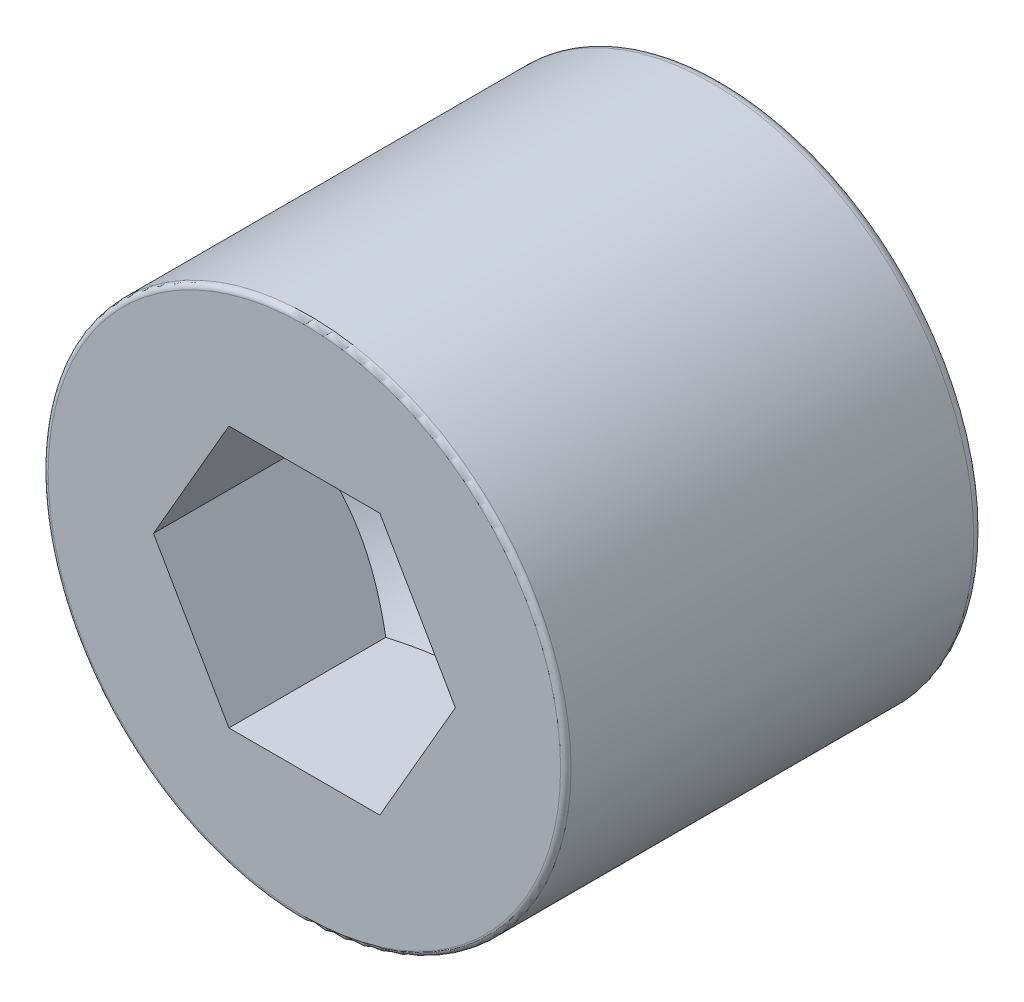
ISO-10303-21;
HEADER;
FILE_DESCRIPTION(('STEP AP214'),'2;1');
FILE_NAME('part.step','',(''),(''),'','','');
FILE_SCHEMA(('AUTOMOTIVE_DESIGN { 1 0 10303 214 1 1 1 1 }'));
ENDSEC;
DATA;
#1=APPLICATION_CONTEXT('core data for automotive mechanical design processes');
#2=APPLICATION_PROTOCOL_DEFINITION('international standard','automotive_design',2000,#1);
#3=PRODUCT_CONTEXT('',#1,'mechanical');
#4=PRODUCT('Part','Part','',(#3));
#5=PRODUCT_RELATED_PRODUCT_CATEGORY('part','',(#4));
#6=PRODUCT_DEFINITION_FORMATION('','',#4);
#7=PRODUCT_DEFINITION_CONTEXT('part definition',#1,'design');
#8=PRODUCT_DEFINITION('design','',#6,#7);
#9=PRODUCT_DEFINITION_SHAPE('','',#8);
#10=(LENGTH_UNIT() NAMED_UNIT(*) SI_UNIT(.MILLI.,.METRE.));
#11=(NAMED_UNIT(*) PLANE_ANGLE_UNIT() SI_UNIT($,.RADIAN.));
#12=(NAMED_UNIT(*) SI_UNIT($,.STERADIAN.) SOLID_ANGLE_UNIT());
#13=UNCERTAINTY_MEASURE_WITH_UNIT(LENGTH_MEASURE(1.E-05),#10,'distance_accuracy_value','');
#14=(GEOMETRIC_REPRESENTATION_CONTEXT(3) GLOBAL_UNCERTAINTY_ASSIGNED_CONTEXT((#13)) GLOBAL_UNIT_ASSIGNED_CONTEXT((#10,
#11,#12)) REPRESENTATION_CONTEXT('',''));
#15=CARTESIAN_POINT('',(0.,0.,0.));
#16=DIRECTION('',(0.,0.,1.));
#17=DIRECTION('',(1.,0.,0.));
#18=AXIS2_PLACEMENT_3D('',#15,#16,#17);
#19=CARTESIAN_POINT('',(0.,0.,80.));
#20=DIRECTION('',(0.,0.,-1.));
#21=DIRECTION('',(-1.,0.,0.));
#22=AXIS2_PLACEMENT_3D('',#19,#20,#21);
#23=CYLINDRICAL_SURFACE('',#22,9.);
#24=CARTESIAN_POINT('',(0.,0.,2.));
#25=DIRECTION('',(0.,0.,1.));
#26=DIRECTION('',(1.,0.,0.));
#27=AXIS2_PLACEMENT_3D('',#24,#25,#26);
#28=CIRCLE('',#27,9.);
#29=CARTESIAN_POINT('',(9.,0.,2.));
#30=VERTEX_POINT('',#29);
#31=EDGE_CURVE('E153',#30,#30,#28,.F.);
#32=ORIENTED_EDGE('',*,*,#31,.T.);
#33=EDGE_LOOP('',(#32));
#34=FACE_BOUND('',#33,.T.);
#35=CARTESIAN_POINT('',(0.,0.,38.5294857560401));
#36=DIRECTION('',(0.,0.,1.));
#37=DIRECTION('',(1.,0.,0.));
#38=AXIS2_PLACEMENT_3D('',#35,#36,#37);
#39=CIRCLE('',#38,9.);
#40=CARTESIAN_POINT('',(9.00000000000001,0.,38.5294857560401));
#41=VERTEX_POINT('',#40);
#42=EDGE_CURVE('E44',#41,#41,#39,.T.);
#43=ORIENTED_EDGE('',*,*,#42,.T.);
#44=EDGE_LOOP('',(#43));
#45=FACE_BOUND('',#44,.T.);
#46=ADVANCED_FACE('F40',(#34,#45),#23,.F.);
#47=CARTESIAN_POINT('',(0.,0.,80.));
#48=DIRECTION('',(0.,0.,1.));
#49=DIRECTION('',(1.,0.,0.));
#50=AXIS2_PLACEMENT_3D('',#47,#48,#49);
#51=PLANE('',#50);
#52=DIRECTION('',(0.5,0.866025403784439,0.));
#53=VECTOR('',#52,1.);
#54=CARTESIAN_POINT('',(14.4337567297406,-25.,80.));
#55=LINE('',#54,#53);
#56=CARTESIAN_POINT('',(14.4337567297406,-25.,80.));
#57=VERTEX_POINT('',#56);
#58=CARTESIAN_POINT('',(28.8675134594813,0.,80.));
#59=VERTEX_POINT('',#58);
#60=EDGE_CURVE('E56',#57,#59,#55,.T.);
#61=ORIENTED_EDGE('',*,*,#60,.F.);
#62=DIRECTION('',(1.,0.,0.));
#63=VECTOR('',#62,1.);
#64=CARTESIAN_POINT('',(-14.4337567297406,-25.,80.));
#65=LINE('',#64,#63);
#66=CARTESIAN_POINT('',(-14.4337567297406,-25.,80.));
#67=VERTEX_POINT('',#66);
#68=EDGE_CURVE('E110',#67,#57,#65,.T.);
#69=ORIENTED_EDGE('',*,*,#68,.F.);
#70=DIRECTION('',(0.5,-0.866025403784438,0.));
#71=VECTOR('',#70,1.);
#72=CARTESIAN_POINT('',(-28.8675134594813,0.,80.));
#73=LINE('',#72,#71);
#74=CARTESIAN_POINT('',(-28.8675134594813,0.,80.));
#75=VERTEX_POINT('',#74);
#76=EDGE_CURVE('E115',#75,#67,#73,.T.);
#77=ORIENTED_EDGE('',*,*,#76,.F.);
#78=DIRECTION('',(-0.5,-0.866025403784439,0.));
#79=VECTOR('',#78,1.);
#80=CARTESIAN_POINT('',(-14.4337567297406,25.,80.));
#81=LINE('',#80,#79);
#82=CARTESIAN_POINT('',(-14.4337567297406,25.,80.));
#83=VERTEX_POINT('',#82);
#84=EDGE_CURVE('E336',#83,#75,#81,.T.);
#85=ORIENTED_EDGE('',*,*,#84,.F.);
#86=DIRECTION('',(-1.,0.,0.));
#87=VECTOR('',#86,1.);
#88=CARTESIAN_POINT('',(14.4337567297406,25.,80.));
#89=LINE('',#88,#87);
#90=CARTESIAN_POINT('',(14.4337567297406,25.,80.));
#91=VERTEX_POINT('',#90);
#92=EDGE_CURVE('E334',#91,#83,#89,.T.);
#93=ORIENTED_EDGE('',*,*,#92,.F.);
#94=DIRECTION('',(-0.5,0.866025403784438,0.));
#95=VECTOR('',#94,1.);
#96=CARTESIAN_POINT('',(28.8675134594813,0.,80.));
#97=LINE('',#96,#95);
#98=EDGE_CURVE('E337',#59,#91,#97,.T.);
#99=ORIENTED_EDGE('',*,*,#98,.F.);
#100=EDGE_LOOP('',(#61,#69,#77,#85,#93,#99));
#101=FACE_BOUND('',#100,.T.);
#102=CARTESIAN_POINT('',(0.,0.,80.));
#103=DIRECTION('',(0.,0.,1.));
#104=DIRECTION('',(1.,0.,0.));
#105=AXIS2_PLACEMENT_3D('',#102,#103,#104);
#106=CIRCLE('',#105,49.);
#107=CARTESIAN_POINT('',(49.,0.,80.));
#108=VERTEX_POINT('',#107);
#109=EDGE_CURVE('E49',#108,#108,#106,.T.);
#110=ORIENTED_EDGE('',*,*,#109,.T.);
#111=EDGE_LOOP('',(#110));
#112=FACE_BOUND('',#111,.T.);
#113=ADVANCED_FACE('F162',(#101,#112),#51,.T.);
#114=CARTESIAN_POINT('',(0.,0.,0.));
#115=DIRECTION('',(0.,0.,1.));
#116=DIRECTION('',(1.,0.,0.));
#117=AXIS2_PLACEMENT_3D('',#114,#115,#116);
#118=PLANE('',#117);
#119=CARTESIAN_POINT('',(0.,0.,0.));
#120=DIRECTION('',(0.,0.,1.));
#121=DIRECTION('',(1.,0.,0.));
#122=AXIS2_PLACEMENT_3D('',#119,#120,#121);
#123=CIRCLE('',#122,11.);
#124=CARTESIAN_POINT('',(11.,0.,0.));
#125=VERTEX_POINT('',#124);
#126=EDGE_CURVE('E150',#125,#125,#123,.T.);
#127=ORIENTED_EDGE('',*,*,#126,.T.);
#128=EDGE_LOOP('',(#127));
#129=FACE_BOUND('',#128,.T.);
#130=CARTESIAN_POINT('',(0.,0.,0.));
#131=DIRECTION('',(0.,0.,1.));
#132=DIRECTION('',(1.,0.,0.));
#133=AXIS2_PLACEMENT_3D('',#130,#131,#132);
#134=CIRCLE('',#133,48.);
#135=CARTESIAN_POINT('',(48.,0.,0.));
#136=VERTEX_POINT('',#135);
#137=EDGE_CURVE('E147',#136,#136,#134,.F.);
#138=ORIENTED_EDGE('',*,*,#137,.T.);
#139=EDGE_LOOP('',(#138));
#140=FACE_BOUND('',#139,.T.);
#141=ADVANCED_FACE('F182',(#129,#140),#118,.F.);
#142=CARTESIAN_POINT('',(0.,0.,80.));
#143=DIRECTION('',(0.,0.,-1.));
#144=DIRECTION('',(-1.,0.,0.));
#145=AXIS2_PLACEMENT_3D('',#142,#143,#144);
#146=CYLINDRICAL_SURFACE('',#145,50.);
#147=CARTESIAN_POINT('',(0.,0.,79.));
#148=DIRECTION('',(0.,0.,1.));
#149=DIRECTION('',(1.,0.,0.));
#150=AXIS2_PLACEMENT_3D('',#147,#148,#149);
#151=CIRCLE('',#150,50.);
#152=CARTESIAN_POINT('',(50.,0.,79.));
#153=VERTEX_POINT('',#152);
#154=EDGE_CURVE('E12',#153,#153,#151,.F.);
#155=ORIENTED_EDGE('',*,*,#154,.T.);
#156=EDGE_LOOP('',(#155));
#157=FACE_BOUND('',#156,.T.);
#158=CARTESIAN_POINT('',(0.,0.,2.));
#159=DIRECTION('',(0.,0.,1.));
#160=DIRECTION('',(1.,0.,0.));
#161=AXIS2_PLACEMENT_3D('',#158,#159,#160);
#162=CIRCLE('',#161,50.);
#163=CARTESIAN_POINT('',(50.,0.,2.));
#164=VERTEX_POINT('',#163);
#165=EDGE_CURVE('E156',#164,#164,#162,.T.);
#166=ORIENTED_EDGE('',*,*,#165,.T.);
#167=EDGE_LOOP('',(#166));
#168=FACE_BOUND('',#167,.T.);
#169=ADVANCED_FACE('F190',(#157,#168),#146,.T.);
#170=CARTESIAN_POINT('',(0.,0.,2.));
#171=DIRECTION('',(0.,0.,1.));
#172=DIRECTION('',(1.,0.,0.));
#173=AXIS2_PLACEMENT_3D('',#170,#171,#172);
#174=TOROIDAL_SURFACE('',#173,11.,2.);
#175=ORIENTED_EDGE('',*,*,#31,.F.);
#176=EDGE_LOOP('',(#175));
#177=FACE_BOUND('',#176,.T.);
#178=ORIENTED_EDGE('',*,*,#126,.F.);
#179=EDGE_LOOP('',(#178));
#180=FACE_BOUND('',#179,.T.);
#181=ADVANCED_FACE('F173',(#177,#180),#174,.T.);
#182=CARTESIAN_POINT('',(0.,0.,2.));
#183=DIRECTION('',(0.,0.,1.));
#184=DIRECTION('',(1.,0.,0.));
#185=AXIS2_PLACEMENT_3D('',#182,#183,#184);
#186=TOROIDAL_SURFACE('',#185,48.,2.);
#187=ORIENTED_EDGE('',*,*,#137,.F.);
#188=EDGE_LOOP('',(#187));
#189=FACE_BOUND('',#188,.T.);
#190=ORIENTED_EDGE('',*,*,#165,.F.);
#191=EDGE_LOOP('',(#190));
#192=FACE_BOUND('',#191,.T.);
#193=ADVANCED_FACE('F165',(#189,#192),#186,.T.);
#194=CARTESIAN_POINT('',(0.,0.,79.));
#195=DIRECTION('',(0.,0.,1.));
#196=DIRECTION('',(1.,0.,0.));
#197=AXIS2_PLACEMENT_3D('',#194,#195,#196);
#198=TOROIDAL_SURFACE('',#197,49.,1.);
#199=ORIENTED_EDGE('',*,*,#154,.F.);
#200=EDGE_LOOP('',(#199));
#201=FACE_BOUND('',#200,.T.);
#202=ORIENTED_EDGE('',*,*,#109,.F.);
#203=EDGE_LOOP('',(#202));
#204=FACE_BOUND('',#203,.T.);
#205=ADVANCED_FACE('F42',(#201,#204),#198,.T.);
#206=CARTESIAN_POINT('',(14.4337567297406,-25.,50.));
#207=DIRECTION('',(0.866025403784439,-0.5,0.));
#208=DIRECTION('',(0.5,0.866025403784439,0.));
#209=AXIS2_PLACEMENT_3D('',#206,#207,#208);
#210=PLANE('',#209);
#211=ORIENTED_EDGE('',*,*,#60,.T.);
#212=DIRECTION('',(0.,0.,1.));
#213=VECTOR('',#212,1.);
#214=CARTESIAN_POINT('',(28.8675134594813,0.,50.));
#215=LINE('',#214,#213);
#216=CARTESIAN_POINT('',(28.8675134594813,0.,50.));
#217=VERTEX_POINT('',#216);
#218=EDGE_CURVE('E104',#217,#59,#215,.T.);
#219=ORIENTED_EDGE('',*,*,#218,.F.);
#220=CARTESIAN_POINT('',(14.4336412596868,-25.0002,50.0000666670667));
#221=CARTESIAN_POINT('',(14.7508889118247,-24.4507109479152,49.8169171055341));
#222=CARTESIAN_POINT('',(15.0693739986844,-23.8990785960212,49.6420786553923));
#223=CARTESIAN_POINT('',(15.7088980399626,-22.7913904638657,49.3113341590762));
#224=CARTESIAN_POINT('',(16.029937797561,-22.2353332924556,49.155434339716));
#225=CARTESIAN_POINT('',(16.6751984808323,-21.1177090049031,48.8646596482477));
#226=CARTESIAN_POINT('',(16.9994251046204,-20.5561320193355,48.7298349847674));
#227=CARTESIAN_POINT('',(17.6501174874694,-19.4290997521431,48.4841150397879));
#228=CARTESIAN_POINT('',(17.9765830201245,-18.8636448626643,48.3732173744819));
#229=CARTESIAN_POINT('',(18.6234085006283,-17.7433102668017,48.1800588655182));
#230=CARTESIAN_POINT('',(18.9437204702698,-17.1885136611102,48.0971592459733));
#231=CARTESIAN_POINT('',(19.5858120990366,-16.0763783369713,47.9581555673091));
#232=CARTESIAN_POINT('',(19.9075917862933,-15.5190395697991,47.9020520239789));
#233=CARTESIAN_POINT('',(20.5516916852837,-14.4034258195979,47.8180570838615));
#234=CARTESIAN_POINT('',(20.8740107966786,-13.8451527424113,47.7901321630747));
#235=CARTESIAN_POINT('',(21.518946456723,-12.7280914116015,47.7630949862358));
#236=CARTESIAN_POINT('',(21.8415629958732,-12.1693031744313,47.7639818398364));
#237=CARTESIAN_POINT('',(22.4446992895798,-11.1246404698427,47.7925557879463));
#238=CARTESIAN_POINT('',(22.725262001221,-10.6386915985708,47.8167585416179));
#239=CARTESIAN_POINT('',(23.2857176169328,-9.66795399677068,47.8864948204388));
#240=CARTESIAN_POINT('',(23.5656105305395,-9.18316524972548,47.9320280400627));
#241=CARTESIAN_POINT('',(24.1246231385452,-8.21492701058795,48.0436361154744));
#242=CARTESIAN_POINT('',(24.4037419025532,-7.73147912998034,48.1097295463408));
#243=CARTESIAN_POINT('',(24.9606429633196,-6.76689819794393,48.2612883073732));
#244=CARTESIAN_POINT('',(25.2384252657353,-6.2857651367165,48.3467535554646));
#245=CARTESIAN_POINT('',(26.0817131455789,-4.8251476834203,48.6344003548544));
#246=CARTESIAN_POINT('',(26.6448227977787,-3.84981315557773,48.8652790993936));
#247=CARTESIAN_POINT('',(27.4832685916003,-2.39758244128631,49.2583392663285));
#248=CARTESIAN_POINT('',(27.7614738214295,-1.91571684829084,49.3970082231606));
#249=CARTESIAN_POINT('',(28.3159599790537,-0.955318651191974,49.6883846478207));
#250=CARTESIAN_POINT('',(28.5922414257333,-0.476785148354278,49.8410881588956));
#251=CARTESIAN_POINT('',(28.8676289295351,0.000200000000002362,50.0000666670667));
#252=B_SPLINE_CURVE_WITH_KNOTS('',3,(#220,#221,#222,#223,#224,#225,#226,#227,#228,#229,#230,
#231,#232,#233,#234,#235,#236,#237,#238,#239,#240,#241,#242,#243,#244,#245,#246,#247,#248,#249,
#250,#251),.UNSPECIFIED.,.F.,.F.,(4,2,2,2,2,2,2,2,2,2,2,2,2,2,2,4),(0.,1.98125159104182,
3.96315284285218,5.94970601011486,7.9360611689272,9.87343019740896,11.8108365161781,
13.7459351828953,15.6809740508569,17.3655086515647,19.0500191246777,20.7360559068297,
22.4220855456996,25.8684114168823,27.5885724897119,29.3082500776184),.UNSPECIFIED.);
#253=CARTESIAN_POINT('',(14.4337567297406,-25.,50.));
#254=VERTEX_POINT('',#253);
#255=EDGE_CURVE('E93',#254,#217,#252,.T.);
#256=ORIENTED_EDGE('',*,*,#255,.F.);
#257=DIRECTION('',(0.,0.,1.));
#258=VECTOR('',#257,1.);
#259=CARTESIAN_POINT('',(14.4337567297406,-25.,50.));
#260=LINE('',#259,#258);
#261=EDGE_CURVE('E99',#254,#57,#260,.T.);
#262=ORIENTED_EDGE('',*,*,#261,.T.);
#263=EDGE_LOOP('',(#211,#219,#256,#262));
#264=FACE_BOUND('',#263,.T.);
#265=ADVANCED_FACE('F109',(#264),#210,.F.);
#266=CARTESIAN_POINT('',(-14.4337567297406,-25.,50.));
#267=DIRECTION('',(0.,-1.,0.));
#268=DIRECTION('',(1.,0.,0.));
#269=AXIS2_PLACEMENT_3D('',#266,#267,#268);
#270=PLANE('',#269);
#271=ORIENTED_EDGE('',*,*,#68,.T.);
#272=ORIENTED_EDGE('',*,*,#261,.F.);
#273=CARTESIAN_POINT('',(-37.3786280358435,-25.,59.2958822184867));
#274=CARTESIAN_POINT('',(-36.8388552327534,-25.,59.036850985562));
#275=CARTESIAN_POINT('',(-36.2984104093411,-25.,58.779215562356));
#276=CARTESIAN_POINT('',(-35.21603736722,-25.,58.2670641793695));
#277=CARTESIAN_POINT('',(-34.6741091312877,-25.,58.012548255998));
#278=CARTESIAN_POINT('',(-33.5885467781655,-25.,57.5069251925922));
#279=CARTESIAN_POINT('',(-33.0449123769917,-25.,57.2558186616244));
#280=CARTESIAN_POINT('',(-31.955884617395,-25.,56.7574550989152));
#281=CARTESIAN_POINT('',(-31.4104912636807,-25.,56.5101980568796));
#282=CARTESIAN_POINT('',(-29.7647982345782,-25.,55.7718679011237));
#283=CARTESIAN_POINT('',(-28.6615617651282,-25.,55.2873110938846));
#284=CARTESIAN_POINT('',(-26.4458262535642,-25.,54.3398964377087));
#285=CARTESIAN_POINT('',(-25.3333276963109,-25.,53.8770374612197));
#286=CARTESIAN_POINT('',(-23.6416553810389,-25.,53.1975281155783));
#287=CARTESIAN_POINT('',(-23.0665528889063,-25.,52.9707314640416));
#288=CARTESIAN_POINT('',(-21.9131724026882,-25.,52.5253728640735));
#289=CARTESIAN_POINT('',(-21.3348944633614,-25.,52.3068107741497));
#290=CARTESIAN_POINT('',(-20.174802120437,-25.,51.8789839494646));
#291=CARTESIAN_POINT('',(-19.5929871898587,-25.,51.6697206407502));
#292=CARTESIAN_POINT('',(-18.4256633278359,-25.,51.2617948798092));
#293=CARTESIAN_POINT('',(-17.8401544904733,-25.,51.0631321588002));
#294=CARTESIAN_POINT('',(-16.6665181108975,-25.,50.6782664038711));
#295=CARTESIAN_POINT('',(-16.0783996190868,-25.,50.4920359159127));
#296=CARTESIAN_POINT('',(-14.8980515685873,-25.,50.133137432599));
#297=CARTESIAN_POINT('',(-14.3058219369265,-25.,49.9604696786527));
#298=CARTESIAN_POINT('',(-12.5230331179468,-25.,49.4655015997467));
#299=CARTESIAN_POINT('',(-11.3258916388716,-25.,49.166075382867));
#300=CARTESIAN_POINT('',(-9.51901467196414,-25.,48.7746300198537));
#301=CARTESIAN_POINT('',(-8.91543096160008,-25.,48.6538499281121));
#302=CARTESIAN_POINT('',(-7.70441022066199,-25.,48.4333093979484));
#303=CARTESIAN_POINT('',(-7.09697328482719,-25.,48.3335484447765));
#304=CARTESIAN_POINT('',(-5.87877515615449,-25.,48.1568785906656));
#305=CARTESIAN_POINT('',(-5.2680139903006,-25.,48.0799695045104));
#306=CARTESIAN_POINT('',(-4.04389058173445,-25.,47.9505727394633));
#307=CARTESIAN_POINT('',(-3.43052833715562,-25.,47.8980850780997));
#308=CARTESIAN_POINT('',(-2.20948213178967,-25.,47.8191677212989));
#309=CARTESIAN_POINT('',(-1.60181793213749,-25.,47.7924340540852));
#310=CARTESIAN_POINT('',(-0.385908180868519,-25.,47.7645484935129));
#311=CARTESIAN_POINT('',(0.222337361915223,-25.,47.7633962174565));
#312=CARTESIAN_POINT('',(1.43836097454638,-25.,47.786702372281));
#313=CARTESIAN_POINT('',(2.04613902553107,-25.,47.8111617873556));
#314=CARTESIAN_POINT('',(3.26017235434913,-25.,47.8851273389064));
#315=CARTESIAN_POINT('',(3.8664275615681,-25.,47.9346346160682));
#316=CARTESIAN_POINT('',(5.36546813489193,-25.,48.0870288189561));
#317=CARTESIAN_POINT('',(6.25683174210596,-25.,48.204116765392));
#318=CARTESIAN_POINT('',(8.03204357922813,-25.,48.4857184972776));
#319=CARTESIAN_POINT('',(8.91589057874481,-25.,48.6502398989181));
#320=CARTESIAN_POINT('',(10.6755235037868,-25.,49.0208538968513));
#321=CARTESIAN_POINT('',(11.5513019729617,-25.,49.2269815623319));
#322=CARTESIAN_POINT('',(13.2936626924976,-25.,49.6746157916052));
#323=CARTESIAN_POINT('',(14.1602451674398,-25.,49.9161214892665));
#324=CARTESIAN_POINT('',(15.9038409641552,-25.,50.4346116089262));
#325=CARTESIAN_POINT('',(16.7806524929279,-25.,50.7122701210075));
#326=CARTESIAN_POINT('',(18.5256348751455,-25.,51.2933926062178));
#327=CARTESIAN_POINT('',(19.3938056665137,-25.,51.5968567645904));
#328=CARTESIAN_POINT('',(21.1220037403272,-25.,52.2250285210473));
#329=CARTESIAN_POINT('',(21.9820341555807,-25.,52.5497275319089));
#330=CARTESIAN_POINT('',(23.2668680503094,-25.,53.0500556339158));
#331=CARTESIAN_POINT('',(23.6942760907681,-25.,53.2190443934588));
#332=CARTESIAN_POINT('',(24.5474711747725,-25.,53.5610704721676));
#333=CARTESIAN_POINT('',(24.9732582153331,-25.,53.7341077987844));
#334=CARTESIAN_POINT('',(26.0620569884692,-25.,54.182105422256));
#335=CARTESIAN_POINT('',(26.7239767150069,-25.,54.4597204735676));
#336=CARTESIAN_POINT('',(28.044486967676,-25.,55.0227712042759));
#337=CARTESIAN_POINT('',(28.7030774406975,-25.,55.3082070079697));
#338=CARTESIAN_POINT('',(30.0172956997349,-25.,55.885912694956));
#339=CARTESIAN_POINT('',(30.6729233163648,-25.,56.1781829632203));
#340=CARTESIAN_POINT('',(31.9814844244288,-25.,56.7686983721818));
#341=CARTESIAN_POINT('',(32.6344178948933,-25.,57.0669435592786));
#342=CARTESIAN_POINT('',(34.5899228424821,-25.,57.9696765345943));
#343=CARTESIAN_POINT('',(35.8888717056779,-25.,58.5820170371297));
#344=CARTESIAN_POINT('',(38.4788941104991,-25.,59.8229803345879));
#345=CARTESIAN_POINT('',(39.7699678659259,-25.,60.4516026850219));
#346=CARTESIAN_POINT('',(42.3472789889898,-25.,61.722547653344));
#347=CARTESIAN_POINT('',(43.6335086584873,-25.,62.3648858605644));
#348=CARTESIAN_POINT('',(46.2007133259397,-25.,63.6599800138187));
#349=CARTESIAN_POINT('',(47.4816882945463,-25.,64.3127360179382));
#350=CARTESIAN_POINT('',(50.0390876541165,-25.,65.6266255008141));
#351=CARTESIAN_POINT('',(51.3155126980407,-25.,66.2877577099168));
#352=CARTESIAN_POINT('',(53.864719509379,-25.,67.6169964945082));
#353=CARTESIAN_POINT('',(55.1375012848949,-25.,68.2851030544721));
#354=CARTESIAN_POINT('',(57.560016190783,-25.,69.5637899991346));
#355=CARTESIAN_POINT('',(58.7100250496586,-25.,70.1738483765976));
#356=CARTESIAN_POINT('',(61.007874088509,-25.,71.3980370091433));
#357=CARTESIAN_POINT('',(62.1557142658567,-25.,72.0121672691548));
#358=CARTESIAN_POINT('',(65.5965230596837,-25.,73.8598318810514));
#359=CARTESIAN_POINT('',(67.8866870105996,-25.,75.0985908888659));
#360=CARTESIAN_POINT('',(71.3147371079988,-25.,76.9630122388959));
#361=CARTESIAN_POINT('',(72.4547705625667,-25.,77.5847355846914));
#362=CARTESIAN_POINT('',(74.7335783079726,-25.,78.8304873252096));
#363=CARTESIAN_POINT('',(75.8723525984916,-25.,79.4545157205163));
#364=CARTESIAN_POINT('',(78.1487238166177,-25.,80.7045605842728));
#365=CARTESIAN_POINT('',(79.2863208081569,-25.,81.3305769363473));
#366=CARTESIAN_POINT('',(81.5605213286801,-25.,82.5844086967511));
#367=CARTESIAN_POINT('',(82.6971248587801,-25.,83.2122241030559));
#368=CARTESIAN_POINT('',(83.8332921006871,-25.,83.8408273793955));
#369=B_SPLINE_CURVE_WITH_KNOTS('',3,(#273,#274,#275,#276,#277,#278,#279,#280,#281,#282,#283,
#284,#285,#286,#287,#288,#289,#290,#291,#292,#293,#294,#295,#296,#297,#298,#299,#300,#301,#302,
#303,#304,#305,#306,#307,#308,#309,#310,#311,#312,#313,#314,#315,#316,#317,#318,#319,#320,#321,
#322,#323,#324,#325,#326,#327,#328,#329,#330,#331,#332,#333,#334,#335,#336,#337,#338,#339,#340,
#341,#342,#343,#344,#345,#346,#347,#348,#349,#350,#351,#352,#353,#354,#355,#356,#357,#358,#359,
#360,#361,#362,#363,#364,#365,#366,#367,#368),.UNSPECIFIED.,.F.,.F.,(4,2,2,2,2,2,2,2,2,2,2,2,2,
2,2,2,2,2,2,2,2,2,2,2,2,2,2,2,2,2,2,2,2,2,2,2,2,2,2,2,2,2,2,2,2,2,2,4),(0.,1.79612627801978,
3.59227349938963,5.38873747759416,7.18519665088149,10.7998919706196,14.4143992399321,
16.268968179886,18.1235052387367,19.9783257318778,21.8330991729094,23.683631098206,
25.5341959544684,29.233801437253,31.0801556023649,32.9264645457868,34.7727585243247,
36.6190538280196,38.4432803607523,40.2674796030136,42.0917489472916,43.9161013767034,
46.6116440544964,49.3076197855337,52.0058774681752,54.7040691026269,57.4627598274104,
60.2214703568811,62.9790721005294,64.3578645134136,65.736659464069,67.8899370947777,
70.0432489678852,72.196682426353,74.3501326143743,78.6581060189794,82.9659619410952,
87.2790064558673,91.5920750269453,95.9044974700779,100.216910315884,104.12231058985,
108.027715592028,115.838841001263,119.734471302411,123.630102590415,127.525509883735,
131.420912795195),.UNSPECIFIED.);
#370=CARTESIAN_POINT('',(-14.4337567297406,-25.,50.));
#371=VERTEX_POINT('',#370);
#372=EDGE_CURVE('E64',#371,#254,#369,.T.);
#373=ORIENTED_EDGE('',*,*,#372,.F.);
#374=DIRECTION('',(0.,0.,1.));
#375=VECTOR('',#374,1.);
#376=CARTESIAN_POINT('',(-14.4337567297406,-25.,50.));
#377=LINE('',#376,#375);
#378=EDGE_CURVE('E349',#371,#67,#377,.T.);
#379=ORIENTED_EDGE('',*,*,#378,.T.);
#380=EDGE_LOOP('',(#271,#272,#373,#379));
#381=FACE_BOUND('',#380,.T.);
#382=ADVANCED_FACE('F171',(#381),#270,.F.);
#383=CARTESIAN_POINT('',(-28.8675134594813,0.,50.));
#384=DIRECTION('',(-0.866025403784438,-0.5,0.));
#385=DIRECTION('',(0.5,-0.866025403784439,0.));
#386=AXIS2_PLACEMENT_3D('',#383,#384,#385);
#387=PLANE('',#386);
#388=ORIENTED_EDGE('',*,*,#76,.T.);
#389=ORIENTED_EDGE('',*,*,#378,.F.);
#390=CARTESIAN_POINT('',(-28.8676289295351,0.000199999999999942,50.0000666670667));
#391=CARTESIAN_POINT('',(-28.5503812773972,-0.549289052084759,49.8169171055341));
#392=CARTESIAN_POINT('',(-28.2318961905375,-1.10092140397883,49.6420786553923));
#393=CARTESIAN_POINT('',(-27.5923721492594,-2.20860953613432,49.3113341590762));
#394=CARTESIAN_POINT('',(-27.2713323916609,-2.76466670754444,49.155434339716));
#395=CARTESIAN_POINT('',(-26.6260717083896,-3.88229099509688,48.8646596482477));
#396=CARTESIAN_POINT('',(-26.3018450846015,-4.44386798066448,48.7298349847673));
#397=CARTESIAN_POINT('',(-25.6511527017526,-5.57090024785687,48.4841150397878));
#398=CARTESIAN_POINT('',(-25.3246871690974,-6.13635513733567,48.3732173744819));
#399=CARTESIAN_POINT('',(-24.6778616885936,-7.25668973319834,48.1800588655182));
#400=CARTESIAN_POINT('',(-24.3575497189522,-7.8114863388898,48.0971592459732));
#401=CARTESIAN_POINT('',(-23.7154580901853,-8.92362166302866,47.9581555673091));
#402=CARTESIAN_POINT('',(-23.3936784029286,-9.48096043020086,47.9020520239789));
#403=CARTESIAN_POINT('',(-22.7495785039383,-10.5965741804021,47.8180570838615));
#404=CARTESIAN_POINT('',(-22.4272593925433,-11.1548472575886,47.7901321630747));
#405=CARTESIAN_POINT('',(-21.7823237324989,-12.2719085883985,47.7630949862358));
#406=CARTESIAN_POINT('',(-21.4597071933487,-12.8306968255687,47.7639818398364));
#407=CARTESIAN_POINT('',(-20.8565708996422,-13.8753595301573,47.7925557879463));
#408=CARTESIAN_POINT('',(-20.5760081880009,-14.3613084014292,47.8167585416178));
#409=CARTESIAN_POINT('',(-20.0155525722891,-15.3320460032293,47.8864948204388));
#410=CARTESIAN_POINT('',(-19.7356596586825,-15.8168347502745,47.9320280400627));
#411=CARTESIAN_POINT('',(-19.1766470506767,-16.785072989412,48.0436361154744));
#412=CARTESIAN_POINT('',(-18.8975282866688,-17.2685208700197,48.1097295463408));
#413=CARTESIAN_POINT('',(-18.3406272259024,-18.2331018020561,48.2612883073732));
#414=CARTESIAN_POINT('',(-18.0628449234867,-18.7142348632835,48.3467535554646));
#415=CARTESIAN_POINT('',(-17.2195570436431,-20.1748523165797,48.6344003548543));
#416=CARTESIAN_POINT('',(-16.6564473914432,-21.1501868444223,48.8652790993936));
#417=CARTESIAN_POINT('',(-15.8180015976216,-22.6024175587137,49.2583392663284));
#418=CARTESIAN_POINT('',(-15.5397963677925,-23.0842831517092,49.3970082231606));
#419=CARTESIAN_POINT('',(-14.9853102101682,-24.044681348808,49.6883846478207));
#420=CARTESIAN_POINT('',(-14.7090287634886,-24.5232148516457,49.8410881588956));
#421=CARTESIAN_POINT('',(-14.4336412596868,-25.0002,50.0000666670667));
#422=B_SPLINE_CURVE_WITH_KNOTS('',3,(#390,#391,#392,#393,#394,#395,#396,#397,#398,#399,#400,
#401,#402,#403,#404,#405,#406,#407,#408,#409,#410,#411,#412,#413,#414,#415,#416,#417,#418,#419,
#420,#421),.UNSPECIFIED.,.F.,.F.,(4,2,2,2,2,2,2,2,2,2,2,2,2,2,2,4),(0.,1.98125159104182,
3.96315284285219,5.94970601011486,7.9360611689272,9.87343019740897,11.8108365161781,
13.7459351828953,15.6809740508569,17.3655086515647,19.0500191246777,20.7360559068297,
22.4220855456996,25.8684114168823,27.5885724897119,29.3082500776184),.UNSPECIFIED.);
#423=CARTESIAN_POINT('',(-28.8675134594813,0.,50.));
#424=VERTEX_POINT('',#423);
#425=EDGE_CURVE('E141',#424,#371,#422,.T.);
#426=ORIENTED_EDGE('',*,*,#425,.F.);
#427=DIRECTION('',(0.,0.,1.));
#428=VECTOR('',#427,1.);
#429=CARTESIAN_POINT('',(-28.8675134594813,0.,50.));
#430=LINE('',#429,#428);
#431=EDGE_CURVE('E351',#424,#75,#430,.T.);
#432=ORIENTED_EDGE('',*,*,#431,.T.);
#433=EDGE_LOOP('',(#388,#389,#426,#432));
#434=FACE_BOUND('',#433,.T.);
#435=ADVANCED_FACE('F243',(#434),#387,.F.);
#436=CARTESIAN_POINT('',(-14.4337567297406,25.,50.));
#437=DIRECTION('',(-0.866025403784439,0.5,0.));
#438=DIRECTION('',(-0.5,-0.866025403784439,0.));
#439=AXIS2_PLACEMENT_3D('',#436,#437,#438);
#440=PLANE('',#439);
#441=ORIENTED_EDGE('',*,*,#84,.T.);
#442=ORIENTED_EDGE('',*,*,#431,.F.);
#443=CARTESIAN_POINT('',(-14.4336412596868,25.0002,50.0000666670667));
#444=CARTESIAN_POINT('',(-14.7508889118247,24.4507109479152,49.8169171055341));
#445=CARTESIAN_POINT('',(-15.0693739986844,23.8990785960212,49.6420786553923));
#446=CARTESIAN_POINT('',(-15.7088980399626,22.7913904638657,49.3113341590762));
#447=CARTESIAN_POINT('',(-16.029937797561,22.2353332924556,49.155434339716));
#448=CARTESIAN_POINT('',(-16.6751984808323,21.1177090049031,48.8646596482477));
#449=CARTESIAN_POINT('',(-16.9994251046204,20.5561320193355,48.7298349847673));
#450=CARTESIAN_POINT('',(-17.6501174874694,19.4290997521431,48.4841150397878));
#451=CARTESIAN_POINT('',(-17.9765830201245,18.8636448626643,48.3732173744819));
#452=CARTESIAN_POINT('',(-18.6234085006283,17.7433102668017,48.1800588655182));
#453=CARTESIAN_POINT('',(-18.9437204702697,17.1885136611102,48.0971592459732));
#454=CARTESIAN_POINT('',(-19.5858120990366,16.0763783369713,47.9581555673091));
#455=CARTESIAN_POINT('',(-19.9075917862933,15.5190395697991,47.9020520239789));
#456=CARTESIAN_POINT('',(-20.5516916852836,14.4034258195979,47.8180570838615));
#457=CARTESIAN_POINT('',(-20.8740107966786,13.8451527424114,47.7901321630747));
#458=CARTESIAN_POINT('',(-21.518946456723,12.7280914116015,47.7630949862358));
#459=CARTESIAN_POINT('',(-21.8415629958732,12.1693031744313,47.7639818398364));
#460=CARTESIAN_POINT('',(-22.4446992895798,11.1246404698427,47.7925557879463));
#461=CARTESIAN_POINT('',(-22.725262001221,10.6386915985708,47.8167585416178));
#462=CARTESIAN_POINT('',(-23.2857176169328,9.66795399677069,47.8864948204388));
#463=CARTESIAN_POINT('',(-23.5656105305395,9.18316524972549,47.9320280400627));
#464=CARTESIAN_POINT('',(-24.1246231385452,8.21492701058797,48.0436361154744));
#465=CARTESIAN_POINT('',(-24.4037419025532,7.73147912998035,48.1097295463408));
#466=CARTESIAN_POINT('',(-24.9606429633196,6.76689819794394,48.2612883073732));
#467=CARTESIAN_POINT('',(-25.2384252657352,6.28576513671651,48.3467535554646));
#468=CARTESIAN_POINT('',(-26.0817131455789,4.82514768342031,48.6344003548543));
#469=CARTESIAN_POINT('',(-26.6448227977787,3.84981315557773,48.8652790993936));
#470=CARTESIAN_POINT('',(-27.4832685916003,2.39758244128631,49.2583392663284));
#471=CARTESIAN_POINT('',(-27.7614738214295,1.91571684829084,49.3970082231606));
#472=CARTESIAN_POINT('',(-28.3159599790537,0.955318651191977,49.6883846478207));
#473=CARTESIAN_POINT('',(-28.5922414257333,0.476785148354282,49.8410881588956));
#474=CARTESIAN_POINT('',(-28.8676289295351,-0.000199999999998417,50.0000666670667));
#475=B_SPLINE_CURVE_WITH_KNOTS('',3,(#443,#444,#445,#446,#447,#448,#449,#450,#451,#452,#453,
#454,#455,#456,#457,#458,#459,#460,#461,#462,#463,#464,#465,#466,#467,#468,#469,#470,#471,#472,
#473,#474),.UNSPECIFIED.,.F.,.F.,(4,2,2,2,2,2,2,2,2,2,2,2,2,2,2,4),(0.,1.98125159104182,
3.96315284285218,5.94970601011485,7.9360611689272,9.87343019740897,11.8108365161781,
13.7459351828953,15.6809740508569,17.3655086515647,19.0500191246777,20.7360559068297,
22.4220855456996,25.8684114168823,27.5885724897119,29.3082500776184),.UNSPECIFIED.);
#476=CARTESIAN_POINT('',(-14.4337567297406,25.,50.));
#477=VERTEX_POINT('',#476);
#478=EDGE_CURVE('E353',#477,#424,#475,.T.);
#479=ORIENTED_EDGE('',*,*,#478,.F.);
#480=DIRECTION('',(0.,0.,1.));
#481=VECTOR('',#480,1.);
#482=CARTESIAN_POINT('',(-14.4337567297406,25.,50.));
#483=LINE('',#482,#481);
#484=EDGE_CURVE('E112',#477,#83,#483,.T.);
#485=ORIENTED_EDGE('',*,*,#484,.T.);
#486=EDGE_LOOP('',(#441,#442,#479,#485));
#487=FACE_BOUND('',#486,.T.);
#488=ADVANCED_FACE('F255',(#487),#440,.F.);
#489=CARTESIAN_POINT('',(14.4337567297406,25.,50.));
#490=DIRECTION('',(0.,1.,0.));
#491=DIRECTION('',(0.,0.,1.));
#492=AXIS2_PLACEMENT_3D('',#489,#490,#491);
#493=PLANE('',#492);
#494=ORIENTED_EDGE('',*,*,#92,.T.);
#495=ORIENTED_EDGE('',*,*,#484,.F.);
#496=CARTESIAN_POINT('',(-37.3786280358435,25.,59.2958822184867));
#497=CARTESIAN_POINT('',(-36.8388552327534,25.,59.036850985562));
#498=CARTESIAN_POINT('',(-36.2984104093411,25.,58.779215562356));
#499=CARTESIAN_POINT('',(-35.21603736722,25.,58.2670641793695));
#500=CARTESIAN_POINT('',(-34.6741091312877,25.,58.012548255998));
#501=CARTESIAN_POINT('',(-33.5885467781655,25.,57.5069251925922));
#502=CARTESIAN_POINT('',(-33.0449123769917,25.,57.2558186616244));
#503=CARTESIAN_POINT('',(-31.955884617395,25.,56.7574550989152));
#504=CARTESIAN_POINT('',(-31.4104912636807,25.,56.5101980568796));
#505=CARTESIAN_POINT('',(-29.7647982345782,25.,55.7718679011237));
#506=CARTESIAN_POINT('',(-28.6615617651283,25.,55.2873110938846));
#507=CARTESIAN_POINT('',(-26.4458262535642,25.,54.3398964377087));
#508=CARTESIAN_POINT('',(-25.3333276963109,25.,53.8770374612197));
#509=CARTESIAN_POINT('',(-23.6416553810389,25.,53.1975281155783));
#510=CARTESIAN_POINT('',(-23.0665528889063,25.,52.9707314640416));
#511=CARTESIAN_POINT('',(-21.9131724026882,25.,52.5253728640735));
#512=CARTESIAN_POINT('',(-21.3348944633614,25.,52.3068107741497));
#513=CARTESIAN_POINT('',(-20.174802120437,25.,51.8789839494646));
#514=CARTESIAN_POINT('',(-19.5929871898587,25.,51.6697206407502));
#515=CARTESIAN_POINT('',(-18.4256633278359,25.,51.2617948798092));
#516=CARTESIAN_POINT('',(-17.8401544904733,25.,51.0631321588002));
#517=CARTESIAN_POINT('',(-16.6665181108975,25.,50.6782664038711));
#518=CARTESIAN_POINT('',(-16.0783996190869,25.,50.4920359159127));
#519=CARTESIAN_POINT('',(-14.8980515685873,25.,50.133137432599));
#520=CARTESIAN_POINT('',(-14.3058219369265,25.,49.9604696786526));
#521=CARTESIAN_POINT('',(-12.5230331179468,25.,49.4655015997467));
#522=CARTESIAN_POINT('',(-11.3258916388716,25.,49.166075382867));
#523=CARTESIAN_POINT('',(-9.51901467196415,25.,48.7746300198537));
#524=CARTESIAN_POINT('',(-8.91543096160008,25.,48.653849928112));
#525=CARTESIAN_POINT('',(-7.704410220662,25.,48.4333093979484));
#526=CARTESIAN_POINT('',(-7.0969732848272,25.,48.3335484447765));
#527=CARTESIAN_POINT('',(-5.8787751561545,25.,48.1568785906656));
#528=CARTESIAN_POINT('',(-5.26801399030061,25.,48.0799695045104));
#529=CARTESIAN_POINT('',(-4.04389058173446,25.,47.9505727394633));
#530=CARTESIAN_POINT('',(-3.43052833715562,25.,47.8980850780997));
#531=CARTESIAN_POINT('',(-2.20948213178968,25.,47.8191677212989));
#532=CARTESIAN_POINT('',(-1.6018179321375,25.,47.7924340540851));
#533=CARTESIAN_POINT('',(-0.385908180868535,25.,47.7645484935129));
#534=CARTESIAN_POINT('',(0.222337361915207,25.,47.7633962174565));
#535=CARTESIAN_POINT('',(1.43836097454637,25.,47.786702372281));
#536=CARTESIAN_POINT('',(2.04613902553106,25.,47.8111617873556));
#537=CARTESIAN_POINT('',(3.26017235434911,25.,47.8851273389064));
#538=CARTESIAN_POINT('',(3.86642756156808,25.,47.9346346160681));
#539=CARTESIAN_POINT('',(5.36546813489192,25.,48.0870288189561));
#540=CARTESIAN_POINT('',(6.25683174210594,25.,48.204116765392));
#541=CARTESIAN_POINT('',(8.03204357922811,25.,48.4857184972776));
#542=CARTESIAN_POINT('',(8.91589057874479,25.,48.6502398989181));
#543=CARTESIAN_POINT('',(10.6755235037867,25.,49.0208538968513));
#544=CARTESIAN_POINT('',(11.5513019729616,25.,49.2269815623319));
#545=CARTESIAN_POINT('',(13.2936626924976,25.,49.6746157916052));
#546=CARTESIAN_POINT('',(14.1602451674397,25.,49.9161214892665));
#547=CARTESIAN_POINT('',(15.9038409641552,25.,50.4346116089262));
#548=CARTESIAN_POINT('',(16.7806524929278,25.,50.7122701210075));
#549=CARTESIAN_POINT('',(18.5256348751455,25.,51.2933926062178));
#550=CARTESIAN_POINT('',(19.3938056665137,25.,51.5968567645904));
#551=CARTESIAN_POINT('',(21.1220037403272,25.,52.2250285210473));
#552=CARTESIAN_POINT('',(21.9820341555807,25.,52.5497275319089));
#553=CARTESIAN_POINT('',(23.2668680503094,25.,53.0500556339158));
#554=CARTESIAN_POINT('',(23.6942760907681,25.,53.2190443934588));
#555=CARTESIAN_POINT('',(24.5474711747725,25.,53.5610704721675));
#556=CARTESIAN_POINT('',(24.9732582153331,25.,53.7341077987844));
#557=CARTESIAN_POINT('',(26.0620569884692,25.,54.182105422256));
#558=CARTESIAN_POINT('',(26.7239767150069,25.,54.4597204735675));
#559=CARTESIAN_POINT('',(28.044486967676,25.,55.0227712042759));
#560=CARTESIAN_POINT('',(28.7030774406975,25.,55.3082070079696));
#561=CARTESIAN_POINT('',(30.0172956997349,25.,55.8859126949559));
#562=CARTESIAN_POINT('',(30.6729233163648,25.,56.1781829632203));
#563=CARTESIAN_POINT('',(31.9814844244288,25.,56.7686983721817));
#564=CARTESIAN_POINT('',(32.6344178948933,25.,57.0669435592786));
#565=CARTESIAN_POINT('',(34.5899228424821,25.,57.9696765345943));
#566=CARTESIAN_POINT('',(35.8888717056779,25.,58.5820170371297));
#567=CARTESIAN_POINT('',(38.4788941104991,25.,59.8229803345879));
#568=CARTESIAN_POINT('',(39.7699678659259,25.,60.4516026850219));
#569=CARTESIAN_POINT('',(42.3472789889898,25.,61.7225476533439));
#570=CARTESIAN_POINT('',(43.6335086584873,25.,62.3648858605644));
#571=CARTESIAN_POINT('',(46.2007133259397,25.,63.6599800138186));
#572=CARTESIAN_POINT('',(47.4816882945463,25.,64.3127360179381));
#573=CARTESIAN_POINT('',(50.0390876541165,25.,65.6266255008141));
#574=CARTESIAN_POINT('',(51.3155126980407,25.,66.2877577099168));
#575=CARTESIAN_POINT('',(53.864719509379,25.,67.6169964945082));
#576=CARTESIAN_POINT('',(55.1375012848948,25.,68.2851030544721));
#577=CARTESIAN_POINT('',(57.560016190783,25.,69.5637899991346));
#578=CARTESIAN_POINT('',(58.7100250496585,25.,70.1738483765976));
#579=CARTESIAN_POINT('',(61.007874088509,25.,71.3980370091432));
#580=CARTESIAN_POINT('',(62.1557142658567,25.,72.0121672691548));
#581=CARTESIAN_POINT('',(65.5965230596837,25.,73.8598318810514));
#582=CARTESIAN_POINT('',(67.8866870105996,25.,75.0985908888659));
#583=CARTESIAN_POINT('',(71.3147371079988,25.,76.9630122388959));
#584=CARTESIAN_POINT('',(72.4547705625667,25.,77.5847355846914));
#585=CARTESIAN_POINT('',(74.7335783079726,25.,78.8304873252096));
#586=CARTESIAN_POINT('',(75.8723525984916,25.,79.4545157205163));
#587=CARTESIAN_POINT('',(78.1487238166176,25.,80.7045605842728));
#588=CARTESIAN_POINT('',(79.2863208081568,25.,81.3305769363473));
#589=CARTESIAN_POINT('',(81.56052132868,25.,82.5844086967511));
#590=CARTESIAN_POINT('',(82.6971248587801,25.,83.2122241030559));
#591=CARTESIAN_POINT('',(83.8332921006871,25.,83.8408273793955));
#592=B_SPLINE_CURVE_WITH_KNOTS('',3,(#496,#497,#498,#499,#500,#501,#502,#503,#504,#505,#506,
#507,#508,#509,#510,#511,#512,#513,#514,#515,#516,#517,#518,#519,#520,#521,#522,#523,#524,#525,
#526,#527,#528,#529,#530,#531,#532,#533,#534,#535,#536,#537,#538,#539,#540,#541,#542,#543,#544,
#545,#546,#547,#548,#549,#550,#551,#552,#553,#554,#555,#556,#557,#558,#559,#560,#561,#562,#563,
#564,#565,#566,#567,#568,#569,#570,#571,#572,#573,#574,#575,#576,#577,#578,#579,#580,#581,#582,
#583,#584,#585,#586,#587,#588,#589,#590,#591),.UNSPECIFIED.,.F.,.F.,(4,2,2,2,2,2,2,2,2,2,2,2,2,
2,2,2,2,2,2,2,2,2,2,2,2,2,2,2,2,2,2,2,2,2,2,2,2,2,2,2,2,2,2,2,2,2,2,4),(0.,1.79612627801978,
3.59227349938964,5.38873747759416,7.18519665088148,10.7998919706196,14.4143992399321,
16.268968179886,18.1235052387367,19.9783257318778,21.8330991729094,23.683631098206,
25.5341959544684,29.233801437253,31.0801556023649,32.9264645457868,34.7727585243247,
36.6190538280196,38.4432803607523,40.2674796030136,42.0917489472916,43.9161013767034,
46.6116440544964,49.3076197855337,52.0058774681752,54.7040691026269,57.4627598274104,
60.2214703568811,62.9790721005294,64.3578645134136,65.736659464069,67.8899370947777,
70.0432489678852,72.196682426353,74.3501326143743,78.6581060189794,82.9659619410952,
87.2790064558673,91.5920750269453,95.9044974700779,100.216910315884,104.12231058985,
108.027715592028,115.838841001263,119.734471302411,123.630102590416,127.525509883735,
131.420912795195),.UNSPECIFIED.);
#593=CARTESIAN_POINT('',(14.4337567297406,25.,50.));
#594=VERTEX_POINT('',#593);
#595=EDGE_CURVE('E107',#594,#477,#592,.F.);
#596=ORIENTED_EDGE('',*,*,#595,.F.);
#597=DIRECTION('',(0.,0.,1.));
#598=VECTOR('',#597,1.);
#599=CARTESIAN_POINT('',(14.4337567297406,25.,50.));
#600=LINE('',#599,#598);
#601=EDGE_CURVE('E106',#594,#91,#600,.T.);
#602=ORIENTED_EDGE('',*,*,#601,.T.);
#603=EDGE_LOOP('',(#494,#495,#596,#602));
#604=FACE_BOUND('',#603,.T.);
#605=ADVANCED_FACE('F268',(#604),#493,.F.);
#606=CARTESIAN_POINT('',(28.8675134594813,0.,50.));
#607=DIRECTION('',(0.866025403784438,0.5,0.));
#608=DIRECTION('',(-0.5,0.866025403784438,0.));
#609=AXIS2_PLACEMENT_3D('',#606,#607,#608);
#610=PLANE('',#609);
#611=ORIENTED_EDGE('',*,*,#98,.T.);
#612=ORIENTED_EDGE('',*,*,#601,.F.);
#613=CARTESIAN_POINT('',(28.8676289295351,-0.000199999999996527,50.0000666670667));
#614=CARTESIAN_POINT('',(28.5503812773972,0.549289052084764,49.8169171055341));
#615=CARTESIAN_POINT('',(28.2318961905375,1.10092140397883,49.6420786553923));
#616=CARTESIAN_POINT('',(27.5923721492594,2.20860953613432,49.3113341590762));
#617=CARTESIAN_POINT('',(27.2713323916609,2.76466670754444,49.155434339716));
#618=CARTESIAN_POINT('',(26.6260717083896,3.88229099509689,48.8646596482477));
#619=CARTESIAN_POINT('',(26.3018450846015,4.44386798066448,48.7298349847674));
#620=CARTESIAN_POINT('',(25.6511527017526,5.57090024785688,48.4841150397879));
#621=CARTESIAN_POINT('',(25.3246871690974,6.13635513733567,48.3732173744819));
#622=CARTESIAN_POINT('',(24.6778616885936,7.25668973319834,48.1800588655182));
#623=CARTESIAN_POINT('',(24.3575497189522,7.81148633888981,48.0971592459733));
#624=CARTESIAN_POINT('',(23.7154580901853,8.92362166302867,47.9581555673091));
#625=CARTESIAN_POINT('',(23.3936784029286,9.48096043020086,47.9020520239789));
#626=CARTESIAN_POINT('',(22.7495785039383,10.5965741804021,47.8180570838615));
#627=CARTESIAN_POINT('',(22.4272593925433,11.1548472575887,47.7901321630747));
#628=CARTESIAN_POINT('',(21.7823237324989,12.2719085883985,47.7630949862358));
#629=CARTESIAN_POINT('',(21.4597071933487,12.8306968255687,47.7639818398364));
#630=CARTESIAN_POINT('',(20.8565708996422,13.8753595301573,47.7925557879463));
#631=CARTESIAN_POINT('',(20.5760081880009,14.3613084014292,47.8167585416178));
#632=CARTESIAN_POINT('',(20.0155525722891,15.3320460032293,47.8864948204388));
#633=CARTESIAN_POINT('',(19.7356596586825,15.8168347502745,47.9320280400627));
#634=CARTESIAN_POINT('',(19.1766470506767,16.785072989412,48.0436361154744));
#635=CARTESIAN_POINT('',(18.8975282866688,17.2685208700197,48.1097295463408));
#636=CARTESIAN_POINT('',(18.3406272259024,18.2331018020561,48.2612883073732));
#637=CARTESIAN_POINT('',(18.0628449234867,18.7142348632835,48.3467535554646));
#638=CARTESIAN_POINT('',(17.2195570436431,20.1748523165797,48.6344003548544));
#639=CARTESIAN_POINT('',(16.6564473914432,21.1501868444223,48.8652790993936));
#640=CARTESIAN_POINT('',(15.8180015976216,22.6024175587137,49.2583392663285));
#641=CARTESIAN_POINT('',(15.5397963677925,23.0842831517092,49.3970082231606));
#642=CARTESIAN_POINT('',(14.9853102101682,24.044681348808,49.6883846478207));
#643=CARTESIAN_POINT('',(14.7090287634886,24.5232148516457,49.8410881588956));
#644=CARTESIAN_POINT('',(14.4336412596868,25.0002,50.0000666670667));
#645=B_SPLINE_CURVE_WITH_KNOTS('',3,(#613,#614,#615,#616,#617,#618,#619,#620,#621,#622,#623,
#624,#625,#626,#627,#628,#629,#630,#631,#632,#633,#634,#635,#636,#637,#638,#639,#640,#641,#642,
#643,#644),.UNSPECIFIED.,.F.,.F.,(4,2,2,2,2,2,2,2,2,2,2,2,2,2,2,4),(0.,1.98125159104182,
3.96315284285219,5.94970601011486,7.9360611689272,9.87343019740897,11.8108365161781,
13.7459351828953,15.6809740508569,17.3655086515647,19.0500191246777,20.7360559068297,
22.4220855456996,25.8684114168823,27.5885724897119,29.3082500776184),.UNSPECIFIED.);
#646=EDGE_CURVE('E96',#217,#594,#645,.T.);
#647=ORIENTED_EDGE('',*,*,#646,.F.);
#648=ORIENTED_EDGE('',*,*,#218,.T.);
#649=EDGE_LOOP('',(#611,#612,#647,#648));
#650=FACE_BOUND('',#649,.T.);
#651=ADVANCED_FACE('F103',(#650),#610,.F.);
#652=CARTESIAN_POINT('',(0.,0.,50.));
#653=DIRECTION('',(0.,0.,1.));
#654=DIRECTION('',(1.,0.,0.));
#655=AXIS2_PLACEMENT_3D('',#652,#653,#654);
#656=CONICAL_SURFACE('',#655,28.8675134594813,1.0471975511966);
#657=ORIENTED_EDGE('',*,*,#42,.F.);
#658=EDGE_LOOP('',(#657));
#659=FACE_BOUND('',#658,.T.);
#660=ORIENTED_EDGE('',*,*,#372,.T.);
#661=ORIENTED_EDGE('',*,*,#255,.T.);
#662=ORIENTED_EDGE('',*,*,#646,.T.);
#663=ORIENTED_EDGE('',*,*,#595,.T.);
#664=ORIENTED_EDGE('',*,*,#478,.T.);
#665=ORIENTED_EDGE('',*,*,#425,.T.);
#666=EDGE_LOOP('',(#660,#661,#662,#663,#664,#665));
#667=FACE_BOUND('',#666,.T.);
#668=ADVANCED_FACE('F95',(#659,#667),#656,.F.);
#669=CLOSED_SHELL('',(#46,#113,#141,#169,#181,#193,#205,#265,#382,#435,#488,#605,#651,#668));
#670=MANIFOLD_SOLID_BREP('B2',#669);
#671=ADVANCED_BREP_SHAPE_REPRESENTATION('',(#18,#670),#14);
#672=SHAPE_DEFINITION_REPRESENTATION(#9,#671);
ENDSEC;
END-ISO-10303-21;
